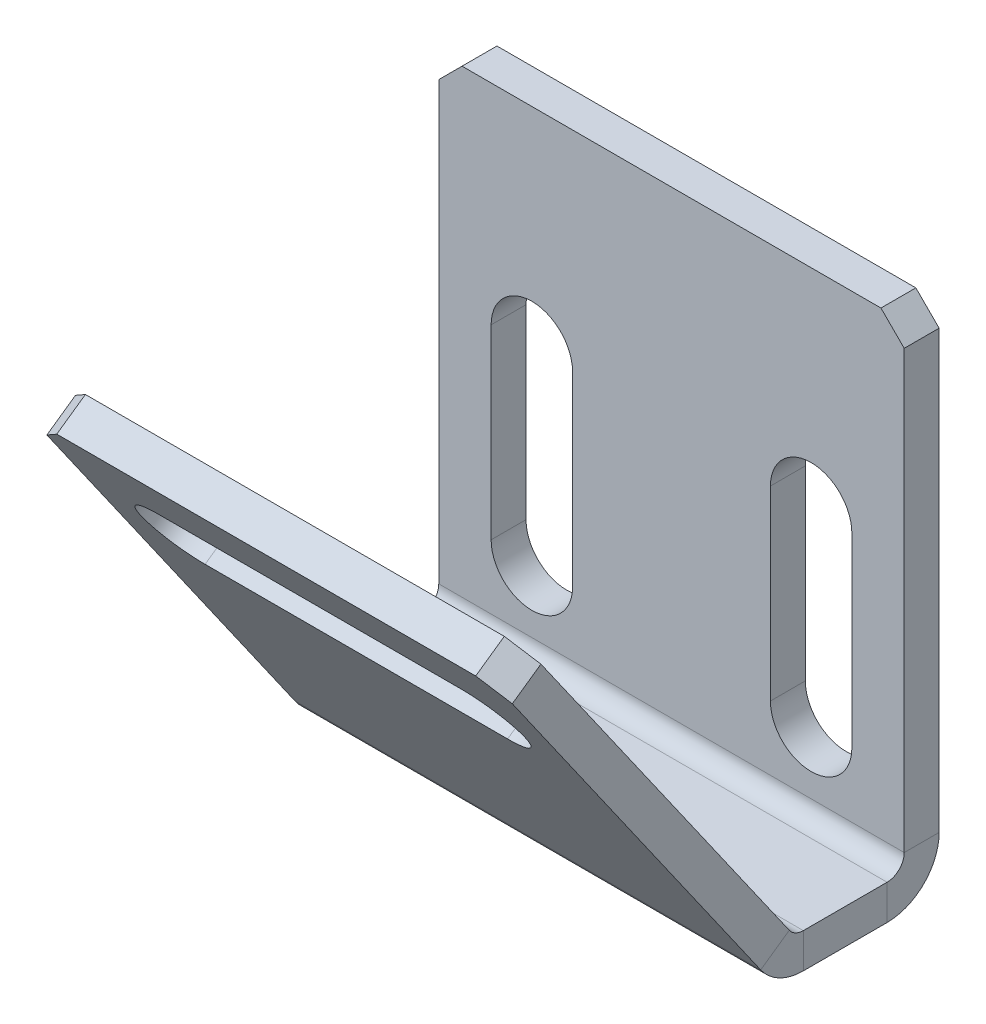
ISO-10303-21;
HEADER;
FILE_DESCRIPTION(('STEP AP214'),'2;1');
FILE_NAME('part.step','',(''),(''),'','','');
FILE_SCHEMA(('AUTOMOTIVE_DESIGN { 1 0 10303 214 1 1 1 1 }'));
ENDSEC;
DATA;
#1=APPLICATION_CONTEXT('core data for automotive mechanical design processes');
#2=APPLICATION_PROTOCOL_DEFINITION('international standard','automotive_design',2000,#1);
#3=PRODUCT_CONTEXT('',#1,'mechanical');
#4=PRODUCT('Part','Part','',(#3));
#5=PRODUCT_RELATED_PRODUCT_CATEGORY('part','',(#4));
#6=PRODUCT_DEFINITION_FORMATION('','',#4);
#7=PRODUCT_DEFINITION_CONTEXT('part definition',#1,'design');
#8=PRODUCT_DEFINITION('design','',#6,#7);
#9=PRODUCT_DEFINITION_SHAPE('','',#8);
#10=(LENGTH_UNIT() NAMED_UNIT(*) SI_UNIT(.MILLI.,.METRE.));
#11=(NAMED_UNIT(*) PLANE_ANGLE_UNIT() SI_UNIT($,.RADIAN.));
#12=(NAMED_UNIT(*) SI_UNIT($,.STERADIAN.) SOLID_ANGLE_UNIT());
#13=UNCERTAINTY_MEASURE_WITH_UNIT(LENGTH_MEASURE(1.E-05),#10,'distance_accuracy_value','');
#14=(GEOMETRIC_REPRESENTATION_CONTEXT(3) GLOBAL_UNCERTAINTY_ASSIGNED_CONTEXT((#13)) GLOBAL_UNIT_ASSIGNED_CONTEXT((#10,
#11,#12)) REPRESENTATION_CONTEXT('',''));
#15=CARTESIAN_POINT('',(0.,0.,0.));
#16=DIRECTION('',(0.,0.,1.));
#17=DIRECTION('',(1.,0.,0.));
#18=AXIS2_PLACEMENT_3D('',#15,#16,#17);
#19=CARTESIAN_POINT('',(11.0198412698413,-21.9206349206349,6.55));
#20=DIRECTION('',(-1.,0.,0.));
#21=DIRECTION('',(0.,0.,1.));
#22=AXIS2_PLACEMENT_3D('',#19,#20,#21);
#23=PLANE('',#22);
#24=DIRECTION('',(0.,-1.,0.));
#25=VECTOR('',#24,1.);
#26=CARTESIAN_POINT('',(11.0198412698413,-20.4206349206349,4.3353884274214));
#27=LINE('',#26,#25);
#28=CARTESIAN_POINT('',(11.0198412698413,-20.4206349206349,4.3353884274214));
#29=VERTEX_POINT('',#28);
#30=CARTESIAN_POINT('',(11.0198412698413,-21.9206349206349,4.3353884274214));
#31=VERTEX_POINT('',#30);
#32=EDGE_CURVE('E328',#29,#31,#27,.T.);
#33=ORIENTED_EDGE('',*,*,#32,.T.);
#34=DIRECTION('',(0.,0.,1.));
#35=VECTOR('',#34,1.);
#36=CARTESIAN_POINT('',(11.0198412698413,-21.9206349206349,0.));
#37=LINE('',#36,#35);
#38=CARTESIAN_POINT('',(11.0198412698413,-21.9206349206349,0.736599999999991));
#39=VERTEX_POINT('',#38);
#40=EDGE_CURVE('E348',#39,#31,#37,.T.);
#41=ORIENTED_EDGE('',*,*,#40,.F.);
#42=DIRECTION('',(0.,1.,0.));
#43=VECTOR('',#42,1.);
#44=CARTESIAN_POINT('',(11.0198412698413,-20.4206349206349,0.736599999999997));
#45=LINE('',#44,#43);
#46=CARTESIAN_POINT('',(11.0198412698413,-20.4206349206349,0.736599999999997));
#47=VERTEX_POINT('',#46);
#48=EDGE_CURVE('E358',#47,#39,#45,.F.);
#49=ORIENTED_EDGE('',*,*,#48,.F.);
#50=DIRECTION('',(0.,0.,-1.));
#51=VECTOR('',#50,1.);
#52=CARTESIAN_POINT('',(11.0198412698413,-20.4206349206349,6.55000000000001));
#53=LINE('',#52,#51);
#54=EDGE_CURVE('E352',#47,#29,#53,.F.);
#55=ORIENTED_EDGE('',*,*,#54,.T.);
#56=EDGE_LOOP('',(#33,#41,#49,#55));
#57=FACE_BOUND('',#56,.T.);
#58=ADVANCED_FACE('F76',(#57),#23,.F.);
#59=CARTESIAN_POINT('',(-8.98015873015873,-21.9206349206349,0.));
#60=DIRECTION('',(1.,0.,0.));
#61=DIRECTION('',(0.,0.,-1.));
#62=AXIS2_PLACEMENT_3D('',#59,#60,#61);
#63=PLANE('',#62);
#64=DIRECTION('',(0.,-1.,0.));
#65=VECTOR('',#64,1.);
#66=CARTESIAN_POINT('',(-8.98015873015873,-20.4206349206349,4.3353884274214));
#67=LINE('',#66,#65);
#68=CARTESIAN_POINT('',(-8.98015873015873,-20.4206349206349,4.3353884274214));
#69=VERTEX_POINT('',#68);
#70=CARTESIAN_POINT('',(-8.98015873015873,-21.9206349206349,4.3353884274214));
#71=VERTEX_POINT('',#70);
#72=EDGE_CURVE('E339',#69,#71,#67,.T.);
#73=ORIENTED_EDGE('',*,*,#72,.F.);
#74=DIRECTION('',(0.,0.,1.));
#75=VECTOR('',#74,1.);
#76=CARTESIAN_POINT('',(-8.98015873015873,-20.4206349206349,0.));
#77=LINE('',#76,#75);
#78=CARTESIAN_POINT('',(-8.98015873015873,-20.4206349206349,0.736599999999997));
#79=VERTEX_POINT('',#78);
#80=EDGE_CURVE('E350',#69,#79,#77,.F.);
#81=ORIENTED_EDGE('',*,*,#80,.T.);
#82=DIRECTION('',(0.,1.,0.));
#83=VECTOR('',#82,1.);
#84=CARTESIAN_POINT('',(-8.98015873015873,-21.9206349206349,0.736599999999991));
#85=LINE('',#84,#83);
#86=CARTESIAN_POINT('',(-8.98015873015873,-21.9206349206349,0.736599999999991));
#87=VERTEX_POINT('',#86);
#88=EDGE_CURVE('E342',#79,#87,#85,.F.);
#89=ORIENTED_EDGE('',*,*,#88,.T.);
#90=DIRECTION('',(0.,0.,-1.));
#91=VECTOR('',#90,1.);
#92=CARTESIAN_POINT('',(-8.98015873015873,-21.9206349206349,0.));
#93=LINE('',#92,#91);
#94=EDGE_CURVE('E345',#71,#87,#93,.T.);
#95=ORIENTED_EDGE('',*,*,#94,.F.);
#96=EDGE_LOOP('',(#73,#81,#89,#95));
#97=FACE_BOUND('',#96,.T.);
#98=ADVANCED_FACE('F532',(#97),#63,.F.);
#99=CARTESIAN_POINT('',(0.,-21.9206349206349,0.));
#100=DIRECTION('',(0.,1.,0.));
#101=DIRECTION('',(0.,0.,1.));
#102=AXIS2_PLACEMENT_3D('',#99,#100,#101);
#103=PLANE('',#102);
#104=DIRECTION('',(1.,0.,0.));
#105=VECTOR('',#104,1.);
#106=CARTESIAN_POINT('',(11.0198412698413,-21.9206349206349,4.3353884274214));
#107=LINE('',#106,#105);
#108=EDGE_CURVE('E322',#31,#71,#107,.F.);
#109=ORIENTED_EDGE('',*,*,#108,.T.);
#110=ORIENTED_EDGE('',*,*,#94,.T.);
#111=DIRECTION('',(1.,0.,0.));
#112=VECTOR('',#111,1.);
#113=CARTESIAN_POINT('',(-8.98015873015873,-21.9206349206349,0.736599999999991));
#114=LINE('',#113,#112);
#115=EDGE_CURVE('E355',#39,#87,#114,.F.);
#116=ORIENTED_EDGE('',*,*,#115,.F.);
#117=ORIENTED_EDGE('',*,*,#40,.T.);
#118=EDGE_LOOP('',(#109,#110,#116,#117));
#119=FACE_BOUND('',#118,.T.);
#120=ADVANCED_FACE('F538',(#119),#103,.F.);
#121=CARTESIAN_POINT('',(0.,-20.4206349206349,0.));
#122=DIRECTION('',(0.,1.,0.));
#123=DIRECTION('',(0.,0.,1.));
#124=AXIS2_PLACEMENT_3D('',#121,#122,#123);
#125=PLANE('',#124);
#126=ORIENTED_EDGE('',*,*,#80,.F.);
#127=DIRECTION('',(1.,0.,0.));
#128=VECTOR('',#127,1.);
#129=CARTESIAN_POINT('',(11.0198412698413,-20.4206349206349,4.3353884274214));
#130=LINE('',#129,#128);
#131=EDGE_CURVE('E334',#29,#69,#130,.F.);
#132=ORIENTED_EDGE('',*,*,#131,.F.);
#133=ORIENTED_EDGE('',*,*,#54,.F.);
#134=DIRECTION('',(1.,0.,0.));
#135=VECTOR('',#134,1.);
#136=CARTESIAN_POINT('',(-8.98015873015873,-20.4206349206349,0.736599999999997));
#137=LINE('',#136,#135);
#138=EDGE_CURVE('E361',#79,#47,#137,.T.);
#139=ORIENTED_EDGE('',*,*,#138,.F.);
#140=EDGE_LOOP('',(#126,#132,#133,#139));
#141=FACE_BOUND('',#140,.T.);
#142=ADVANCED_FACE('F603',(#141),#125,.T.);
#143=CARTESIAN_POINT('',(11.0198412698413,0.0793650793650749,-1.5));
#144=DIRECTION('',(1.,0.,0.));
#145=DIRECTION('',(0.,1.,0.));
#146=AXIS2_PLACEMENT_3D('',#143,#144,#145);
#147=PLANE('',#146);
#148=DIRECTION('',(0.,1.,0.));
#149=VECTOR('',#148,1.);
#150=CARTESIAN_POINT('',(11.0198412698413,0.0793650793650749,-1.5));
#151=LINE('',#150,#149);
#152=CARTESIAN_POINT('',(11.0198412698413,-19.6840349206349,-1.5));
#153=VERTEX_POINT('',#152);
#154=CARTESIAN_POINT('',(11.0198412698413,-0.920634920634923,-1.5));
#155=VERTEX_POINT('',#154);
#156=EDGE_CURVE('E455',#153,#155,#151,.T.);
#157=ORIENTED_EDGE('',*,*,#156,.T.);
#158=DIRECTION('',(0.,0.,1.));
#159=VECTOR('',#158,1.);
#160=CARTESIAN_POINT('',(11.0198412698413,-0.920634920634923,-1.5));
#161=LINE('',#160,#159);
#162=CARTESIAN_POINT('',(11.0198412698413,-0.920634920634923,0.));
#163=VERTEX_POINT('',#162);
#164=EDGE_CURVE('E474',#155,#163,#161,.T.);
#165=ORIENTED_EDGE('',*,*,#164,.T.);
#166=DIRECTION('',(0.,1.,0.));
#167=VECTOR('',#166,1.);
#168=CARTESIAN_POINT('',(11.0198412698413,0.0793650793650749,0.));
#169=LINE('',#168,#167);
#170=CARTESIAN_POINT('',(11.0198412698413,-19.6840349206349,0.));
#171=VERTEX_POINT('',#170);
#172=EDGE_CURVE('E464',#171,#163,#169,.T.);
#173=ORIENTED_EDGE('',*,*,#172,.F.);
#174=DIRECTION('',(0.,0.,-1.));
#175=VECTOR('',#174,1.);
#176=CARTESIAN_POINT('',(11.0198412698413,-19.6840349206349,0.));
#177=LINE('',#176,#175);
#178=EDGE_CURVE('E372',#171,#153,#177,.T.);
#179=ORIENTED_EDGE('',*,*,#178,.T.);
#180=EDGE_LOOP('',(#157,#165,#173,#179));
#181=FACE_BOUND('',#180,.T.);
#182=ADVANCED_FACE('F519',(#181),#147,.T.);
#183=CARTESIAN_POINT('',(0.,0.,-1.5));
#184=DIRECTION('',(0.,0.,1.));
#185=DIRECTION('',(1.,0.,0.));
#186=AXIS2_PLACEMENT_3D('',#183,#184,#185);
#187=PLANE('',#186);
#188=DIRECTION('',(0.,1.,0.));
#189=VECTOR('',#188,1.);
#190=CARTESIAN_POINT('',(-3.23015873015873,-8.92063492063492,-1.5));
#191=LINE('',#190,#189);
#192=CARTESIAN_POINT('',(-3.23015873015873,-16.9206349206349,-1.5));
#193=VERTEX_POINT('',#192);
#194=CARTESIAN_POINT('',(-3.23015873015873,-8.92063492063492,-1.5));
#195=VERTEX_POINT('',#194);
#196=EDGE_CURVE('E431',#193,#195,#191,.T.);
#197=ORIENTED_EDGE('',*,*,#196,.T.);
#198=CARTESIAN_POINT('',(-4.98015873015873,-8.92063492063492,-1.5));
#199=DIRECTION('',(0.,0.,1.));
#200=DIRECTION('',(1.,0.,0.));
#201=AXIS2_PLACEMENT_3D('',#198,#199,#200);
#202=CIRCLE('',#201,1.75);
#203=CARTESIAN_POINT('',(-6.73015873015873,-8.92063492063492,-1.5));
#204=VERTEX_POINT('',#203);
#205=EDGE_CURVE('E421',#195,#204,#202,.T.);
#206=ORIENTED_EDGE('',*,*,#205,.T.);
#207=DIRECTION('',(0.,-1.,0.));
#208=VECTOR('',#207,1.);
#209=CARTESIAN_POINT('',(-6.73015873015873,-8.92063492063492,-1.5));
#210=LINE('',#209,#208);
#211=CARTESIAN_POINT('',(-6.73015873015873,-16.9206349206349,-1.5));
#212=VERTEX_POINT('',#211);
#213=EDGE_CURVE('E424',#204,#212,#210,.T.);
#214=ORIENTED_EDGE('',*,*,#213,.T.);
#215=CARTESIAN_POINT('',(-4.98015873015873,-16.9206349206349,-1.5));
#216=DIRECTION('',(0.,0.,1.));
#217=DIRECTION('',(1.,0.,0.));
#218=AXIS2_PLACEMENT_3D('',#215,#216,#217);
#219=CIRCLE('',#218,1.75);
#220=EDGE_CURVE('E428',#212,#193,#219,.T.);
#221=ORIENTED_EDGE('',*,*,#220,.T.);
#222=EDGE_LOOP('',(#197,#206,#214,#221));
#223=FACE_BOUND('',#222,.T.);
#224=DIRECTION('',(0.,1.,0.));
#225=VECTOR('',#224,1.);
#226=CARTESIAN_POINT('',(8.76984126984127,-8.92063492063492,-1.5));
#227=LINE('',#226,#225);
#228=CARTESIAN_POINT('',(8.76984126984127,-16.9206349206349,-1.5));
#229=VERTEX_POINT('',#228);
#230=CARTESIAN_POINT('',(8.76984126984127,-8.92063492063492,-1.5));
#231=VERTEX_POINT('',#230);
#232=EDGE_CURVE('E399',#229,#231,#227,.T.);
#233=ORIENTED_EDGE('',*,*,#232,.T.);
#234=CARTESIAN_POINT('',(7.01984126984127,-8.92063492063492,-1.5));
#235=DIRECTION('',(0.,0.,1.));
#236=DIRECTION('',(1.,0.,0.));
#237=AXIS2_PLACEMENT_3D('',#234,#235,#236);
#238=CIRCLE('',#237,1.75);
#239=CARTESIAN_POINT('',(5.26984126984127,-8.92063492063492,-1.5));
#240=VERTEX_POINT('',#239);
#241=EDGE_CURVE('E389',#231,#240,#238,.T.);
#242=ORIENTED_EDGE('',*,*,#241,.T.);
#243=DIRECTION('',(0.,-1.,0.));
#244=VECTOR('',#243,1.);
#245=CARTESIAN_POINT('',(5.26984126984127,-8.92063492063492,-1.5));
#246=LINE('',#245,#244);
#247=CARTESIAN_POINT('',(5.26984126984127,-16.9206349206349,-1.5));
#248=VERTEX_POINT('',#247);
#249=EDGE_CURVE('E392',#240,#248,#246,.T.);
#250=ORIENTED_EDGE('',*,*,#249,.T.);
#251=CARTESIAN_POINT('',(7.01984126984127,-16.9206349206349,-1.5));
#252=DIRECTION('',(0.,0.,1.));
#253=DIRECTION('',(1.,0.,0.));
#254=AXIS2_PLACEMENT_3D('',#251,#252,#253);
#255=CIRCLE('',#254,1.75);
#256=EDGE_CURVE('E396',#248,#229,#255,.T.);
#257=ORIENTED_EDGE('',*,*,#256,.T.);
#258=EDGE_LOOP('',(#233,#242,#250,#257));
#259=FACE_BOUND('',#258,.T.);
#260=DIRECTION('',(0.,-1.,0.));
#261=VECTOR('',#260,1.);
#262=CARTESIAN_POINT('',(-8.98015873015873,0.0793650793650749,-1.5));
#263=LINE('',#262,#261);
#264=CARTESIAN_POINT('',(-8.98015873015873,-0.92063492063494,-1.5));
#265=VERTEX_POINT('',#264);
#266=CARTESIAN_POINT('',(-8.98015873015873,-19.6840349206349,-1.5));
#267=VERTEX_POINT('',#266);
#268=EDGE_CURVE('E453',#265,#267,#263,.T.);
#269=ORIENTED_EDGE('',*,*,#268,.F.);
#270=DIRECTION('',(-0.707106781186546,-0.707106781186549,0.));
#271=VECTOR('',#270,1.);
#272=CARTESIAN_POINT('',(-7.98015873015872,0.0793650793650749,-1.5));
#273=LINE('',#272,#271);
#274=CARTESIAN_POINT('',(-7.98015873015872,0.0793650793650749,-1.5));
#275=VERTEX_POINT('',#274);
#276=EDGE_CURVE('E13',#265,#275,#273,.F.);
#277=ORIENTED_EDGE('',*,*,#276,.T.);
#278=DIRECTION('',(-1.,0.,0.));
#279=VECTOR('',#278,1.);
#280=CARTESIAN_POINT('',(-8.98015873015873,0.0793650793650749,-1.5));
#281=LINE('',#280,#279);
#282=CARTESIAN_POINT('',(10.0198412698413,0.0793650793650749,-1.5));
#283=VERTEX_POINT('',#282);
#284=EDGE_CURVE('E459',#283,#275,#281,.T.);
#285=ORIENTED_EDGE('',*,*,#284,.F.);
#286=DIRECTION('',(-0.707106781186549,0.707106781186546,0.));
#287=VECTOR('',#286,1.);
#288=CARTESIAN_POINT('',(11.0198412698413,-0.920634920634922,-1.5));
#289=LINE('',#288,#287);
#290=EDGE_CURVE('E481',#283,#155,#289,.F.);
#291=ORIENTED_EDGE('',*,*,#290,.T.);
#292=ORIENTED_EDGE('',*,*,#156,.F.);
#293=DIRECTION('',(1.,0.,0.));
#294=VECTOR('',#293,1.);
#295=CARTESIAN_POINT('',(11.0198412698413,-19.6840349206349,-1.5));
#296=LINE('',#295,#294);
#297=EDGE_CURVE('E365',#153,#267,#296,.F.);
#298=ORIENTED_EDGE('',*,*,#297,.T.);
#299=EDGE_LOOP('',(#269,#277,#285,#291,#292,#298));
#300=FACE_BOUND('',#299,.T.);
#301=ADVANCED_FACE('F523',(#223,#259,#300),#187,.F.);
#302=CARTESIAN_POINT('',(0.,0.,0.));
#303=DIRECTION('',(0.,0.,1.));
#304=DIRECTION('',(1.,0.,0.));
#305=AXIS2_PLACEMENT_3D('',#302,#303,#304);
#306=PLANE('',#305);
#307=CARTESIAN_POINT('',(7.01984126984127,-8.92063492063492,0.));
#308=DIRECTION('',(0.,0.,1.));
#309=DIRECTION('',(1.,0.,0.));
#310=AXIS2_PLACEMENT_3D('',#307,#308,#309);
#311=CIRCLE('',#310,1.75);
#312=CARTESIAN_POINT('',(8.76984126984127,-8.92063492063492,0.));
#313=VERTEX_POINT('',#312);
#314=CARTESIAN_POINT('',(5.26984126984127,-8.92063492063492,0.));
#315=VERTEX_POINT('',#314);
#316=EDGE_CURVE('E386',#313,#315,#311,.T.);
#317=ORIENTED_EDGE('',*,*,#316,.F.);
#318=DIRECTION('',(0.,1.,0.));
#319=VECTOR('',#318,1.);
#320=CARTESIAN_POINT('',(8.76984126984127,-8.92063492063492,0.));
#321=LINE('',#320,#319);
#322=CARTESIAN_POINT('',(8.76984126984127,-16.9206349206349,0.));
#323=VERTEX_POINT('',#322);
#324=EDGE_CURVE('E393',#323,#313,#321,.T.);
#325=ORIENTED_EDGE('',*,*,#324,.F.);
#326=CARTESIAN_POINT('',(7.01984126984127,-16.9206349206349,0.));
#327=DIRECTION('',(0.,0.,1.));
#328=DIRECTION('',(1.,0.,0.));
#329=AXIS2_PLACEMENT_3D('',#326,#327,#328);
#330=CIRCLE('',#329,1.75);
#331=CARTESIAN_POINT('',(5.26984126984127,-16.9206349206349,0.));
#332=VERTEX_POINT('',#331);
#333=EDGE_CURVE('E407',#332,#323,#330,.T.);
#334=ORIENTED_EDGE('',*,*,#333,.F.);
#335=DIRECTION('',(0.,-1.,0.));
#336=VECTOR('',#335,1.);
#337=CARTESIAN_POINT('',(5.26984126984127,-8.92063492063492,0.));
#338=LINE('',#337,#336);
#339=EDGE_CURVE('E404',#315,#332,#338,.T.);
#340=ORIENTED_EDGE('',*,*,#339,.F.);
#341=EDGE_LOOP('',(#317,#325,#334,#340));
#342=FACE_BOUND('',#341,.T.);
#343=CARTESIAN_POINT('',(-4.98015873015873,-8.92063492063492,0.));
#344=DIRECTION('',(0.,0.,1.));
#345=DIRECTION('',(1.,0.,0.));
#346=AXIS2_PLACEMENT_3D('',#343,#344,#345);
#347=CIRCLE('',#346,1.75);
#348=CARTESIAN_POINT('',(-3.23015873015873,-8.92063492063492,0.));
#349=VERTEX_POINT('',#348);
#350=CARTESIAN_POINT('',(-6.73015873015873,-8.92063492063492,0.));
#351=VERTEX_POINT('',#350);
#352=EDGE_CURVE('E414',#349,#351,#347,.T.);
#353=ORIENTED_EDGE('',*,*,#352,.F.);
#354=DIRECTION('',(0.,1.,0.));
#355=VECTOR('',#354,1.);
#356=CARTESIAN_POINT('',(-3.23015873015873,-8.92063492063492,0.));
#357=LINE('',#356,#355);
#358=CARTESIAN_POINT('',(-3.23015873015873,-16.9206349206349,0.));
#359=VERTEX_POINT('',#358);
#360=EDGE_CURVE('E425',#359,#349,#357,.T.);
#361=ORIENTED_EDGE('',*,*,#360,.F.);
#362=CARTESIAN_POINT('',(-4.98015873015873,-16.9206349206349,0.));
#363=DIRECTION('',(0.,0.,1.));
#364=DIRECTION('',(1.,0.,0.));
#365=AXIS2_PLACEMENT_3D('',#362,#363,#364);
#366=CIRCLE('',#365,1.75);
#367=CARTESIAN_POINT('',(-6.73015873015873,-16.9206349206349,0.));
#368=VERTEX_POINT('',#367);
#369=EDGE_CURVE('E439',#368,#359,#366,.T.);
#370=ORIENTED_EDGE('',*,*,#369,.F.);
#371=DIRECTION('',(0.,-1.,0.));
#372=VECTOR('',#371,1.);
#373=CARTESIAN_POINT('',(-6.73015873015873,-8.92063492063492,0.));
#374=LINE('',#373,#372);
#375=EDGE_CURVE('E436',#351,#368,#374,.T.);
#376=ORIENTED_EDGE('',*,*,#375,.F.);
#377=EDGE_LOOP('',(#353,#361,#370,#376));
#378=FACE_BOUND('',#377,.T.);
#379=DIRECTION('',(-1.,0.,0.));
#380=VECTOR('',#379,1.);
#381=CARTESIAN_POINT('',(-8.98015873015873,0.0793650793650749,0.));
#382=LINE('',#381,#380);
#383=CARTESIAN_POINT('',(10.0198412698413,0.0793650793650749,0.));
#384=VERTEX_POINT('',#383);
#385=CARTESIAN_POINT('',(-7.98015873015872,0.0793650793650749,0.));
#386=VERTEX_POINT('',#385);
#387=EDGE_CURVE('E456',#384,#386,#382,.T.);
#388=ORIENTED_EDGE('',*,*,#387,.T.);
#389=DIRECTION('',(0.707106781186546,0.707106781186549,0.));
#390=VECTOR('',#389,1.);
#391=CARTESIAN_POINT('',(-4.02976190476191,4.0297619047619,0.));
#392=LINE('',#391,#390);
#393=CARTESIAN_POINT('',(-8.98015873015873,-0.92063492063494,0.));
#394=VERTEX_POINT('',#393);
#395=EDGE_CURVE('E98',#386,#394,#392,.F.);
#396=ORIENTED_EDGE('',*,*,#395,.T.);
#397=DIRECTION('',(0.,-1.,0.));
#398=VECTOR('',#397,1.);
#399=CARTESIAN_POINT('',(-8.98015873015873,0.0793650793650749,0.));
#400=LINE('',#399,#398);
#401=CARTESIAN_POINT('',(-8.98015873015873,-19.6840349206349,0.));
#402=VERTEX_POINT('',#401);
#403=EDGE_CURVE('E446',#394,#402,#400,.T.);
#404=ORIENTED_EDGE('',*,*,#403,.T.);
#405=DIRECTION('',(1.,0.,0.));
#406=VECTOR('',#405,1.);
#407=CARTESIAN_POINT('',(11.0198412698413,-19.6840349206349,0.));
#408=LINE('',#407,#406);
#409=EDGE_CURVE('E378',#171,#402,#408,.F.);
#410=ORIENTED_EDGE('',*,*,#409,.F.);
#411=ORIENTED_EDGE('',*,*,#172,.T.);
#412=DIRECTION('',(0.707106781186549,-0.707106781186546,0.));
#413=VECTOR('',#412,1.);
#414=CARTESIAN_POINT('',(5.04960317460315,5.04960317460317,0.));
#415=LINE('',#414,#413);
#416=EDGE_CURVE('E477',#163,#384,#415,.F.);
#417=ORIENTED_EDGE('',*,*,#416,.T.);
#418=EDGE_LOOP('',(#388,#396,#404,#410,#411,#417));
#419=FACE_BOUND('',#418,.T.);
#420=ADVANCED_FACE('F512',(#342,#378,#419),#306,.T.);
#421=CARTESIAN_POINT('',(-8.98015873015873,0.0793650793650749,-1.5));
#422=DIRECTION('',(-1.,0.,0.));
#423=DIRECTION('',(0.,-1.,0.));
#424=AXIS2_PLACEMENT_3D('',#421,#422,#423);
#425=PLANE('',#424);
#426=ORIENTED_EDGE('',*,*,#403,.F.);
#427=DIRECTION('',(0.,0.,-1.));
#428=VECTOR('',#427,1.);
#429=CARTESIAN_POINT('',(-8.98015873015873,-0.92063492063494,-1.5));
#430=LINE('',#429,#428);
#431=EDGE_CURVE('E84',#394,#265,#430,.T.);
#432=ORIENTED_EDGE('',*,*,#431,.T.);
#433=ORIENTED_EDGE('',*,*,#268,.T.);
#434=DIRECTION('',(0.,0.,-1.));
#435=VECTOR('',#434,1.);
#436=CARTESIAN_POINT('',(-8.98015873015873,-19.6840349206349,0.));
#437=LINE('',#436,#435);
#438=EDGE_CURVE('E383',#402,#267,#437,.T.);
#439=ORIENTED_EDGE('',*,*,#438,.F.);
#440=EDGE_LOOP('',(#426,#432,#433,#439));
#441=FACE_BOUND('',#440,.T.);
#442=ADVANCED_FACE('F597',(#441),#425,.T.);
#443=CARTESIAN_POINT('',(-8.98015873015873,0.0793650793650749,-1.5));
#444=DIRECTION('',(0.,1.,0.));
#445=DIRECTION('',(0.,0.,1.));
#446=AXIS2_PLACEMENT_3D('',#443,#444,#445);
#447=PLANE('',#446);
#448=ORIENTED_EDGE('',*,*,#284,.T.);
#449=DIRECTION('',(0.,0.,1.));
#450=VECTOR('',#449,1.);
#451=CARTESIAN_POINT('',(-7.98015873015872,0.0793650793650749,-1.5));
#452=LINE('',#451,#450);
#453=EDGE_CURVE('E501',#275,#386,#452,.T.);
#454=ORIENTED_EDGE('',*,*,#453,.T.);
#455=ORIENTED_EDGE('',*,*,#387,.F.);
#456=DIRECTION('',(0.,0.,-1.));
#457=VECTOR('',#456,1.);
#458=CARTESIAN_POINT('',(10.0198412698413,0.0793650793650749,-1.5));
#459=LINE('',#458,#457);
#460=EDGE_CURVE('E479',#384,#283,#459,.T.);
#461=ORIENTED_EDGE('',*,*,#460,.T.);
#462=EDGE_LOOP('',(#448,#454,#455,#461));
#463=FACE_BOUND('',#462,.T.);
#464=ADVANCED_FACE('F507',(#463),#447,.T.);
#465=CARTESIAN_POINT('',(-4.98015873015873,-8.92063492063492,-1.5));
#466=DIRECTION('',(0.,0.,1.));
#467=DIRECTION('',(1.,0.,0.));
#468=AXIS2_PLACEMENT_3D('',#465,#466,#467);
#469=CYLINDRICAL_SURFACE('',#468,1.75);
#470=ORIENTED_EDGE('',*,*,#352,.T.);
#471=DIRECTION('',(0.,0.,1.));
#472=VECTOR('',#471,1.);
#473=CARTESIAN_POINT('',(-6.73015873015873,-8.92063492063492,-1.5));
#474=LINE('',#473,#472);
#475=EDGE_CURVE('E434',#204,#351,#474,.T.);
#476=ORIENTED_EDGE('',*,*,#475,.F.);
#477=ORIENTED_EDGE('',*,*,#205,.F.);
#478=DIRECTION('',(0.,0.,1.));
#479=VECTOR('',#478,1.);
#480=CARTESIAN_POINT('',(-3.23015873015873,-8.92063492063492,-1.5));
#481=LINE('',#480,#479);
#482=EDGE_CURVE('E444',#195,#349,#481,.T.);
#483=ORIENTED_EDGE('',*,*,#482,.T.);
#484=EDGE_LOOP('',(#470,#476,#477,#483));
#485=FACE_BOUND('',#484,.T.);
#486=ADVANCED_FACE('F581',(#485),#469,.F.);
#487=CARTESIAN_POINT('',(-3.23015873015873,-8.92063492063492,-1.5));
#488=DIRECTION('',(1.,0.,0.));
#489=DIRECTION('',(0.,1.,0.));
#490=AXIS2_PLACEMENT_3D('',#487,#488,#489);
#491=PLANE('',#490);
#492=ORIENTED_EDGE('',*,*,#360,.T.);
#493=ORIENTED_EDGE('',*,*,#482,.F.);
#494=ORIENTED_EDGE('',*,*,#196,.F.);
#495=DIRECTION('',(0.,0.,1.));
#496=VECTOR('',#495,1.);
#497=CARTESIAN_POINT('',(-3.23015873015873,-16.9206349206349,-1.5));
#498=LINE('',#497,#496);
#499=EDGE_CURVE('E447',#193,#359,#498,.T.);
#500=ORIENTED_EDGE('',*,*,#499,.T.);
#501=EDGE_LOOP('',(#492,#493,#494,#500));
#502=FACE_BOUND('',#501,.T.);
#503=ADVANCED_FACE('F577',(#502),#491,.F.);
#504=CARTESIAN_POINT('',(-4.98015873015873,-16.9206349206349,-1.5));
#505=DIRECTION('',(0.,0.,1.));
#506=DIRECTION('',(1.,0.,0.));
#507=AXIS2_PLACEMENT_3D('',#504,#505,#506);
#508=CYLINDRICAL_SURFACE('',#507,1.75);
#509=ORIENTED_EDGE('',*,*,#369,.T.);
#510=ORIENTED_EDGE('',*,*,#499,.F.);
#511=ORIENTED_EDGE('',*,*,#220,.F.);
#512=DIRECTION('',(0.,0.,1.));
#513=VECTOR('',#512,1.);
#514=CARTESIAN_POINT('',(-6.73015873015873,-16.9206349206349,-1.5));
#515=LINE('',#514,#513);
#516=EDGE_CURVE('E449',#212,#368,#515,.T.);
#517=ORIENTED_EDGE('',*,*,#516,.T.);
#518=EDGE_LOOP('',(#509,#510,#511,#517));
#519=FACE_BOUND('',#518,.T.);
#520=ADVANCED_FACE('F580',(#519),#508,.F.);
#521=CARTESIAN_POINT('',(-6.73015873015873,-8.92063492063492,-1.5));
#522=DIRECTION('',(-1.,0.,0.));
#523=DIRECTION('',(0.,-1.,0.));
#524=AXIS2_PLACEMENT_3D('',#521,#522,#523);
#525=PLANE('',#524);
#526=ORIENTED_EDGE('',*,*,#375,.T.);
#527=ORIENTED_EDGE('',*,*,#516,.F.);
#528=ORIENTED_EDGE('',*,*,#213,.F.);
#529=ORIENTED_EDGE('',*,*,#475,.T.);
#530=EDGE_LOOP('',(#526,#527,#528,#529));
#531=FACE_BOUND('',#530,.T.);
#532=ADVANCED_FACE('F575',(#531),#525,.F.);
#533=CARTESIAN_POINT('',(7.01984126984127,-8.92063492063492,-1.5));
#534=DIRECTION('',(0.,0.,1.));
#535=DIRECTION('',(1.,0.,0.));
#536=AXIS2_PLACEMENT_3D('',#533,#534,#535);
#537=CYLINDRICAL_SURFACE('',#536,1.75);
#538=ORIENTED_EDGE('',*,*,#316,.T.);
#539=DIRECTION('',(0.,0.,1.));
#540=VECTOR('',#539,1.);
#541=CARTESIAN_POINT('',(5.26984126984127,-8.92063492063492,-1.5));
#542=LINE('',#541,#540);
#543=EDGE_CURVE('E402',#240,#315,#542,.T.);
#544=ORIENTED_EDGE('',*,*,#543,.F.);
#545=ORIENTED_EDGE('',*,*,#241,.F.);
#546=DIRECTION('',(0.,0.,1.));
#547=VECTOR('',#546,1.);
#548=CARTESIAN_POINT('',(8.76984126984127,-8.92063492063492,-1.5));
#549=LINE('',#548,#547);
#550=EDGE_CURVE('E412',#231,#313,#549,.T.);
#551=ORIENTED_EDGE('',*,*,#550,.T.);
#552=EDGE_LOOP('',(#538,#544,#545,#551));
#553=FACE_BOUND('',#552,.T.);
#554=ADVANCED_FACE('F565',(#553),#537,.F.);
#555=CARTESIAN_POINT('',(8.76984126984127,-8.92063492063492,-1.5));
#556=DIRECTION('',(1.,0.,0.));
#557=DIRECTION('',(0.,0.,-1.));
#558=AXIS2_PLACEMENT_3D('',#555,#556,#557);
#559=PLANE('',#558);
#560=ORIENTED_EDGE('',*,*,#324,.T.);
#561=ORIENTED_EDGE('',*,*,#550,.F.);
#562=ORIENTED_EDGE('',*,*,#232,.F.);
#563=DIRECTION('',(0.,0.,1.));
#564=VECTOR('',#563,1.);
#565=CARTESIAN_POINT('',(8.76984126984127,-16.9206349206349,-1.5));
#566=LINE('',#565,#564);
#567=EDGE_CURVE('E415',#229,#323,#566,.T.);
#568=ORIENTED_EDGE('',*,*,#567,.T.);
#569=EDGE_LOOP('',(#560,#561,#562,#568));
#570=FACE_BOUND('',#569,.T.);
#571=ADVANCED_FACE('F561',(#570),#559,.F.);
#572=CARTESIAN_POINT('',(7.01984126984127,-16.9206349206349,-1.5));
#573=DIRECTION('',(0.,0.,1.));
#574=DIRECTION('',(1.,0.,0.));
#575=AXIS2_PLACEMENT_3D('',#572,#573,#574);
#576=CYLINDRICAL_SURFACE('',#575,1.75);
#577=ORIENTED_EDGE('',*,*,#333,.T.);
#578=ORIENTED_EDGE('',*,*,#567,.F.);
#579=ORIENTED_EDGE('',*,*,#256,.F.);
#580=DIRECTION('',(0.,0.,1.));
#581=VECTOR('',#580,1.);
#582=CARTESIAN_POINT('',(5.26984126984127,-16.9206349206349,-1.5));
#583=LINE('',#582,#581);
#584=EDGE_CURVE('E417',#248,#332,#583,.T.);
#585=ORIENTED_EDGE('',*,*,#584,.T.);
#586=EDGE_LOOP('',(#577,#578,#579,#585));
#587=FACE_BOUND('',#586,.T.);
#588=ADVANCED_FACE('F564',(#587),#576,.F.);
#589=CARTESIAN_POINT('',(5.26984126984127,-8.92063492063492,-1.5));
#590=DIRECTION('',(-1.,0.,0.));
#591=DIRECTION('',(0.,0.,1.));
#592=AXIS2_PLACEMENT_3D('',#589,#590,#591);
#593=PLANE('',#592);
#594=ORIENTED_EDGE('',*,*,#339,.T.);
#595=ORIENTED_EDGE('',*,*,#584,.F.);
#596=ORIENTED_EDGE('',*,*,#249,.F.);
#597=ORIENTED_EDGE('',*,*,#543,.T.);
#598=EDGE_LOOP('',(#594,#595,#596,#597));
#599=FACE_BOUND('',#598,.T.);
#600=ADVANCED_FACE('F556',(#599),#593,.F.);
#601=CARTESIAN_POINT('',(-8.98015873015873,-19.6840349206349,0.7366));
#602=DIRECTION('',(-1.,0.,0.));
#603=DIRECTION('',(0.,0.,1.));
#604=AXIS2_PLACEMENT_3D('',#601,#602,#603);
#605=PLANE('',#604);
#606=ORIENTED_EDGE('',*,*,#88,.F.);
#607=CARTESIAN_POINT('',(-8.98015873015873,-19.6840349206349,0.7366));
#608=DIRECTION('',(1.,0.,0.));
#609=DIRECTION('',(0.,0.,-1.));
#610=AXIS2_PLACEMENT_3D('',#607,#608,#609);
#611=CIRCLE('',#610,0.7366);
#612=EDGE_CURVE('E375',#402,#79,#611,.F.);
#613=ORIENTED_EDGE('',*,*,#612,.F.);
#614=ORIENTED_EDGE('',*,*,#438,.T.);
#615=CARTESIAN_POINT('',(-8.98015873015873,-19.6840349206349,0.7366));
#616=DIRECTION('',(1.,0.,0.));
#617=DIRECTION('',(0.,0.,-1.));
#618=AXIS2_PLACEMENT_3D('',#615,#616,#617);
#619=CIRCLE('',#618,2.2366);
#620=EDGE_CURVE('E368',#267,#87,#619,.F.);
#621=ORIENTED_EDGE('',*,*,#620,.T.);
#622=EDGE_LOOP('',(#606,#613,#614,#621));
#623=FACE_BOUND('',#622,.T.);
#624=ADVANCED_FACE('F553',(#623),#605,.T.);
#625=CARTESIAN_POINT('',(11.0198412698413,-19.6840349206349,0.7366));
#626=DIRECTION('',(-1.,0.,0.));
#627=DIRECTION('',(0.,0.,1.));
#628=AXIS2_PLACEMENT_3D('',#625,#626,#627);
#629=PLANE('',#628);
#630=CARTESIAN_POINT('',(11.0198412698413,-19.6840349206349,0.7366));
#631=DIRECTION('',(1.,0.,0.));
#632=DIRECTION('',(0.,0.,-1.));
#633=AXIS2_PLACEMENT_3D('',#630,#631,#632);
#634=CIRCLE('',#633,0.7366);
#635=EDGE_CURVE('E347',#47,#171,#634,.T.);
#636=ORIENTED_EDGE('',*,*,#635,.F.);
#637=ORIENTED_EDGE('',*,*,#48,.T.);
#638=CARTESIAN_POINT('',(11.0198412698413,-19.6840349206349,0.7366));
#639=DIRECTION('',(1.,0.,0.));
#640=DIRECTION('',(0.,0.,-1.));
#641=AXIS2_PLACEMENT_3D('',#638,#639,#640);
#642=CIRCLE('',#641,2.2366);
#643=EDGE_CURVE('E369',#39,#153,#642,.T.);
#644=ORIENTED_EDGE('',*,*,#643,.T.);
#645=ORIENTED_EDGE('',*,*,#178,.F.);
#646=EDGE_LOOP('',(#636,#637,#644,#645));
#647=FACE_BOUND('',#646,.T.);
#648=ADVANCED_FACE('F547',(#647),#629,.F.);
#649=CARTESIAN_POINT('',(11.0198412698413,-19.6840349206349,0.7366));
#650=DIRECTION('',(1.,0.,0.));
#651=DIRECTION('',(0.,-1.,0.));
#652=AXIS2_PLACEMENT_3D('',#649,#650,#651);
#653=CYLINDRICAL_SURFACE('',#652,2.2366);
#654=ORIENTED_EDGE('',*,*,#297,.F.);
#655=ORIENTED_EDGE('',*,*,#643,.F.);
#656=ORIENTED_EDGE('',*,*,#115,.T.);
#657=ORIENTED_EDGE('',*,*,#620,.F.);
#658=EDGE_LOOP('',(#654,#655,#656,#657));
#659=FACE_BOUND('',#658,.T.);
#660=ADVANCED_FACE('F543',(#659),#653,.T.);
#661=CARTESIAN_POINT('',(11.0198412698413,-19.6840349206349,0.7366));
#662=DIRECTION('',(1.,0.,0.));
#663=DIRECTION('',(0.,-1.,0.));
#664=AXIS2_PLACEMENT_3D('',#661,#662,#663);
#665=CYLINDRICAL_SURFACE('',#664,0.7366);
#666=ORIENTED_EDGE('',*,*,#409,.T.);
#667=ORIENTED_EDGE('',*,*,#612,.T.);
#668=ORIENTED_EDGE('',*,*,#138,.T.);
#669=ORIENTED_EDGE('',*,*,#635,.T.);
#670=EDGE_LOOP('',(#666,#667,#668,#669));
#671=FACE_BOUND('',#670,.T.);
#672=ADVANCED_FACE('F546',(#671),#665,.F.);
#673=CARTESIAN_POINT('',(-8.98015873015873,-19.6840349206349,4.3353884274214));
#674=DIRECTION('',(-1.,0.,0.));
#675=DIRECTION('',(0.,0.,1.));
#676=AXIS2_PLACEMENT_3D('',#673,#674,#675);
#677=PLANE('',#676);
#678=DIRECTION('',(0.,0.573576436351053,-0.819152044288987));
#679=VECTOR('',#678,1.);
#680=CARTESIAN_POINT('',(-8.98015873015873,-20.9668959781777,6.16750388967815));
#681=LINE('',#680,#679);
#682=CARTESIAN_POINT('',(-8.98015873015873,-20.1065313236511,4.93877582324467));
#683=VERTEX_POINT('',#682);
#684=CARTESIAN_POINT('',(-8.98015873015873,-20.9668959781777,6.16750388967815));
#685=VERTEX_POINT('',#684);
#686=EDGE_CURVE('E292',#683,#685,#681,.F.);
#687=ORIENTED_EDGE('',*,*,#686,.F.);
#688=CARTESIAN_POINT('',(-8.98015873015873,-19.6840349206349,4.3353884274214));
#689=DIRECTION('',(1.,0.,0.));
#690=DIRECTION('',(0.,0.,-1.));
#691=AXIS2_PLACEMENT_3D('',#688,#689,#690);
#692=CIRCLE('',#691,0.736599999999999);
#693=EDGE_CURVE('E331',#69,#683,#692,.F.);
#694=ORIENTED_EDGE('',*,*,#693,.F.);
#695=ORIENTED_EDGE('',*,*,#72,.T.);
#696=CARTESIAN_POINT('',(-8.98015873015873,-19.6840349206349,4.3353884274214));
#697=DIRECTION('',(1.,0.,0.));
#698=DIRECTION('',(0.,0.,-1.));
#699=AXIS2_PLACEMENT_3D('',#696,#697,#698);
#700=CIRCLE('',#699,2.2366);
#701=EDGE_CURVE('E324',#71,#685,#700,.F.);
#702=ORIENTED_EDGE('',*,*,#701,.T.);
#703=EDGE_LOOP('',(#687,#694,#695,#702));
#704=FACE_BOUND('',#703,.T.);
#705=ADVANCED_FACE('F551',(#704),#677,.T.);
#706=CARTESIAN_POINT('',(11.0198412698413,-19.6840349206349,4.3353884274214));
#707=DIRECTION('',(-1.,0.,0.));
#708=DIRECTION('',(0.,0.,1.));
#709=AXIS2_PLACEMENT_3D('',#706,#707,#708);
#710=PLANE('',#709);
#711=CARTESIAN_POINT('',(11.0198412698413,-19.6840349206349,4.3353884274214));
#712=DIRECTION('',(1.,0.,0.));
#713=DIRECTION('',(0.,0.,-1.));
#714=AXIS2_PLACEMENT_3D('',#711,#712,#713);
#715=CIRCLE('',#714,0.736599999999999);
#716=CARTESIAN_POINT('',(11.0198412698413,-20.1065313236511,4.93877582324467));
#717=VERTEX_POINT('',#716);
#718=EDGE_CURVE('E297',#717,#29,#715,.T.);
#719=ORIENTED_EDGE('',*,*,#718,.F.);
#720=DIRECTION('',(0.,0.573576436351053,-0.819152044288987));
#721=VECTOR('',#720,1.);
#722=CARTESIAN_POINT('',(11.0198412698413,-20.1065313236511,4.93877582324467));
#723=LINE('',#722,#721);
#724=CARTESIAN_POINT('',(11.0198412698413,-20.9668959781777,6.16750388967815));
#725=VERTEX_POINT('',#724);
#726=EDGE_CURVE('E315',#717,#725,#723,.F.);
#727=ORIENTED_EDGE('',*,*,#726,.T.);
#728=CARTESIAN_POINT('',(11.0198412698413,-19.6840349206349,4.3353884274214));
#729=DIRECTION('',(1.,0.,0.));
#730=DIRECTION('',(0.,0.,-1.));
#731=AXIS2_PLACEMENT_3D('',#728,#729,#730);
#732=CIRCLE('',#731,2.2366);
#733=EDGE_CURVE('E325',#725,#31,#732,.T.);
#734=ORIENTED_EDGE('',*,*,#733,.T.);
#735=ORIENTED_EDGE('',*,*,#32,.F.);
#736=EDGE_LOOP('',(#719,#727,#734,#735));
#737=FACE_BOUND('',#736,.T.);
#738=ADVANCED_FACE('F643',(#737),#710,.F.);
#739=CARTESIAN_POINT('',(11.0198412698413,-19.6840349206349,4.3353884274214));
#740=DIRECTION('',(1.,0.,0.));
#741=DIRECTION('',(0.,-0.573576436351053,0.819152044288987));
#742=AXIS2_PLACEMENT_3D('',#739,#740,#741);
#743=CYLINDRICAL_SURFACE('',#742,2.2366);
#744=ORIENTED_EDGE('',*,*,#108,.F.);
#745=ORIENTED_EDGE('',*,*,#733,.F.);
#746=DIRECTION('',(1.,0.,0.));
#747=VECTOR('',#746,1.);
#748=CARTESIAN_POINT('',(-8.98015873015873,-20.9668959781777,6.16750388967815));
#749=LINE('',#748,#747);
#750=EDGE_CURVE('E312',#725,#685,#749,.F.);
#751=ORIENTED_EDGE('',*,*,#750,.T.);
#752=ORIENTED_EDGE('',*,*,#701,.F.);
#753=EDGE_LOOP('',(#744,#745,#751,#752));
#754=FACE_BOUND('',#753,.T.);
#755=ADVANCED_FACE('F647',(#754),#743,.T.);
#756=CARTESIAN_POINT('',(11.0198412698413,-19.6840349206349,4.3353884274214));
#757=DIRECTION('',(1.,0.,0.));
#758=DIRECTION('',(0.,-0.573576436351053,0.819152044288987));
#759=AXIS2_PLACEMENT_3D('',#756,#757,#758);
#760=CYLINDRICAL_SURFACE('',#759,0.736599999999999);
#761=ORIENTED_EDGE('',*,*,#131,.T.);
#762=ORIENTED_EDGE('',*,*,#693,.T.);
#763=DIRECTION('',(1.,0.,0.));
#764=VECTOR('',#763,1.);
#765=CARTESIAN_POINT('',(-8.98015873015873,-20.1065313236511,4.93877582324467));
#766=LINE('',#765,#764);
#767=EDGE_CURVE('E318',#683,#717,#766,.T.);
#768=ORIENTED_EDGE('',*,*,#767,.T.);
#769=ORIENTED_EDGE('',*,*,#718,.T.);
#770=EDGE_LOOP('',(#761,#762,#768,#769));
#771=FACE_BOUND('',#770,.T.);
#772=ADVANCED_FACE('F634',(#771),#760,.F.);
#773=CARTESIAN_POINT('',(11.0198412698413,-4.90684696075269,17.4128712756968));
#774=DIRECTION('',(-1.,0.,0.));
#775=DIRECTION('',(0.,0.,1.));
#776=AXIS2_PLACEMENT_3D('',#773,#774,#775);
#777=PLANE('',#776);
#778=DIRECTION('',(0.,-0.819152044288987,-0.573576436351053));
#779=VECTOR('',#778,1.);
#780=CARTESIAN_POINT('',(11.0198412698413,-4.04648230622611,16.1841432092633));
#781=LINE('',#780,#779);
#782=CARTESIAN_POINT('',(11.0198412698413,-4.86563435051509,15.6105667729123));
#783=VERTEX_POINT('',#782);
#784=EDGE_CURVE('E309',#717,#783,#781,.F.);
#785=ORIENTED_EDGE('',*,*,#784,.T.);
#786=DIRECTION('',(0.,-0.573576436351053,0.819152044288987));
#787=VECTOR('',#786,1.);
#788=CARTESIAN_POINT('',(11.0198412698413,-5.72599900504167,16.8392948393457));
#789=LINE('',#788,#787);
#790=CARTESIAN_POINT('',(11.0198412698413,-5.72599900504167,16.8392948393457));
#791=VERTEX_POINT('',#790);
#792=EDGE_CURVE('E492',#783,#791,#789,.T.);
#793=ORIENTED_EDGE('',*,*,#792,.T.);
#794=DIRECTION('',(0.,0.819152044288987,0.573576436351053));
#795=VECTOR('',#794,1.);
#796=CARTESIAN_POINT('',(11.0198412698413,-10.6560412067397,13.3872421260247));
#797=LINE('',#796,#795);
#798=EDGE_CURVE('E301',#725,#791,#797,.T.);
#799=ORIENTED_EDGE('',*,*,#798,.F.);
#800=ORIENTED_EDGE('',*,*,#726,.F.);
#801=EDGE_LOOP('',(#785,#793,#799,#800));
#802=FACE_BOUND('',#801,.T.);
#803=ADVANCED_FACE('F641',(#802),#777,.F.);
#804=CARTESIAN_POINT('',(-8.98015873015873,-21.2809995751615,5.94756618329129));
#805=DIRECTION('',(1.,0.,0.));
#806=DIRECTION('',(0.,0.,-1.));
#807=AXIS2_PLACEMENT_3D('',#804,#805,#806);
#808=PLANE('',#807);
#809=DIRECTION('',(0.,-0.819152044288987,-0.573576436351053));
#810=VECTOR('',#809,1.);
#811=CARTESIAN_POINT('',(-8.98015873015873,-10.6560412067397,13.3872421260247));
#812=LINE('',#811,#810);
#813=CARTESIAN_POINT('',(-8.98015873015873,-5.72599900504168,16.8392948393457));
#814=VERTEX_POINT('',#813);
#815=EDGE_CURVE('E295',#814,#685,#812,.T.);
#816=ORIENTED_EDGE('',*,*,#815,.F.);
#817=DIRECTION('',(0.,0.573576436351053,-0.819152044288987));
#818=VECTOR('',#817,1.);
#819=CARTESIAN_POINT('',(-8.98015873015873,-5.72599900504168,16.8392948393457));
#820=LINE('',#819,#818);
#821=CARTESIAN_POINT('',(-8.98015873015873,-4.8656343505151,15.6105667729123));
#822=VERTEX_POINT('',#821);
#823=EDGE_CURVE('E498',#814,#822,#820,.T.);
#824=ORIENTED_EDGE('',*,*,#823,.T.);
#825=DIRECTION('',(0.,0.819152044288987,0.573576436351053));
#826=VECTOR('',#825,1.);
#827=CARTESIAN_POINT('',(-8.98015873015873,-20.4206349206349,4.71883811685781));
#828=LINE('',#827,#826);
#829=EDGE_CURVE('E304',#822,#683,#828,.F.);
#830=ORIENTED_EDGE('',*,*,#829,.T.);
#831=ORIENTED_EDGE('',*,*,#686,.T.);
#832=EDGE_LOOP('',(#816,#824,#830,#831));
#833=FACE_BOUND('',#832,.T.);
#834=ADVANCED_FACE('F626',(#833),#808,.F.);
#835=CARTESIAN_POINT('',(0.,-10.6560412067397,13.3872421260247));
#836=DIRECTION('',(0.,0.573576436351053,-0.819152044288987));
#837=DIRECTION('',(0.,0.819152044288987,0.573576436351053));
#838=AXIS2_PLACEMENT_3D('',#835,#836,#837);
#839=PLANE('',#838);
#840=DIRECTION('',(-1.,0.,0.));
#841=VECTOR('',#840,1.);
#842=CARTESIAN_POINT('',(7.51984126984128,-7.5690911046919,15.5487478575559));
#843=LINE('',#842,#841);
#844=CARTESIAN_POINT('',(7.51984126984128,-7.56909110469189,15.5487478575559));
#845=VERTEX_POINT('',#844);
#846=CARTESIAN_POINT('',(-5.48015873015872,-7.5690911046919,15.5487478575559));
#847=VERTEX_POINT('',#846);
#848=EDGE_CURVE('E275',#845,#847,#843,.T.);
#849=ORIENTED_EDGE('',*,*,#848,.F.);
#850=CARTESIAN_POINT('',(7.51984126984128,-9.00260718219762,14.5449890939415));
#851=DIRECTION('',(0.,-0.573576436351053,0.819152044288987));
#852=DIRECTION('',(0.,-0.819152044288987,-0.573576436351053));
#853=AXIS2_PLACEMENT_3D('',#850,#851,#852);
#854=CIRCLE('',#853,1.75);
#855=CARTESIAN_POINT('',(7.51984126984128,-10.4361232597034,13.5412303303272));
#856=VERTEX_POINT('',#855);
#857=EDGE_CURVE('E280',#856,#845,#854,.T.);
#858=ORIENTED_EDGE('',*,*,#857,.F.);
#859=DIRECTION('',(1.,0.,0.));
#860=VECTOR('',#859,1.);
#861=CARTESIAN_POINT('',(7.51984126984128,-10.4361232597034,13.5412303303272));
#862=LINE('',#861,#860);
#863=CARTESIAN_POINT('',(-5.48015873015872,-10.4361232597034,13.5412303303272));
#864=VERTEX_POINT('',#863);
#865=EDGE_CURVE('E285',#864,#856,#862,.T.);
#866=ORIENTED_EDGE('',*,*,#865,.F.);
#867=CARTESIAN_POINT('',(-5.48015873015872,-9.00260718219762,14.5449890939415));
#868=DIRECTION('',(0.,-0.573576436351053,0.819152044288987));
#869=DIRECTION('',(0.,-0.819152044288987,-0.573576436351053));
#870=AXIS2_PLACEMENT_3D('',#867,#868,#869);
#871=CIRCLE('',#870,1.75);
#872=EDGE_CURVE('E264',#847,#864,#871,.T.);
#873=ORIENTED_EDGE('',*,*,#872,.F.);
#874=EDGE_LOOP('',(#849,#858,#866,#873));
#875=FACE_BOUND('',#874,.T.);
#876=ORIENTED_EDGE('',*,*,#798,.T.);
#877=DIRECTION('',(0.707106781186548,-0.579227965339566,-0.405579787672644));
#878=VECTOR('',#877,1.);
#879=CARTESIAN_POINT('',(10.0198412698413,-4.90684696075269,17.4128712756968));
#880=LINE('',#879,#878);
#881=CARTESIAN_POINT('',(10.0198412698413,-4.90684696075269,17.4128712756968));
#882=VERTEX_POINT('',#881);
#883=EDGE_CURVE('E496',#791,#882,#880,.F.);
#884=ORIENTED_EDGE('',*,*,#883,.T.);
#885=DIRECTION('',(-1.,0.,0.));
#886=VECTOR('',#885,1.);
#887=CARTESIAN_POINT('',(0.,-4.90684696075269,17.4128712756968));
#888=LINE('',#887,#886);
#889=CARTESIAN_POINT('',(-7.98015873015872,-4.90684696075269,17.4128712756968));
#890=VERTEX_POINT('',#889);
#891=EDGE_CURVE('E298',#882,#890,#888,.T.);
#892=ORIENTED_EDGE('',*,*,#891,.T.);
#893=DIRECTION('',(0.707106781186549,0.579227965339565,0.405579787672643));
#894=VECTOR('',#893,1.);
#895=CARTESIAN_POINT('',(-8.98015873015873,-5.72599900504168,16.8392948393457));
#896=LINE('',#895,#894);
#897=EDGE_CURVE('E494',#890,#814,#896,.F.);
#898=ORIENTED_EDGE('',*,*,#897,.T.);
#899=ORIENTED_EDGE('',*,*,#815,.T.);
#900=ORIENTED_EDGE('',*,*,#750,.F.);
#901=EDGE_LOOP('',(#876,#884,#892,#898,#899,#900));
#902=FACE_BOUND('',#901,.T.);
#903=ADVANCED_FACE('F282',(#875,#902),#839,.F.);
#904=CARTESIAN_POINT('',(0.,-9.79567655221314,12.1585140595912));
#905=DIRECTION('',(0.,0.573576436351053,-0.819152044288987));
#906=DIRECTION('',(0.,0.819152044288987,0.573576436351053));
#907=AXIS2_PLACEMENT_3D('',#904,#905,#906);
#908=PLANE('',#907);
#909=CARTESIAN_POINT('',(7.51984126984128,-8.14224252767104,13.3162610275081));
#910=DIRECTION('',(0.,0.573576436351053,-0.819152044288987));
#911=DIRECTION('',(0.,0.819152044288987,0.573576436351053));
#912=AXIS2_PLACEMENT_3D('',#909,#910,#911);
#913=CIRCLE('',#912,1.75);
#914=CARTESIAN_POINT('',(7.51984126984128,-6.70872645016532,14.3200197911224));
#915=VERTEX_POINT('',#914);
#916=CARTESIAN_POINT('',(7.51984126984128,-9.57575860517677,12.3125022638937));
#917=VERTEX_POINT('',#916);
#918=EDGE_CURVE('E472',#915,#917,#913,.T.);
#919=ORIENTED_EDGE('',*,*,#918,.F.);
#920=DIRECTION('',(1.,0.,0.));
#921=VECTOR('',#920,1.);
#922=CARTESIAN_POINT('',(0.,-6.70872645016531,14.3200197911224));
#923=LINE('',#922,#921);
#924=CARTESIAN_POINT('',(-5.48015873015872,-6.70872645016532,14.3200197911224));
#925=VERTEX_POINT('',#924);
#926=EDGE_CURVE('E462',#925,#915,#923,.T.);
#927=ORIENTED_EDGE('',*,*,#926,.F.);
#928=CARTESIAN_POINT('',(-5.48015873015872,-8.14224252767104,13.3162610275081));
#929=DIRECTION('',(0.,0.573576436351053,-0.819152044288987));
#930=DIRECTION('',(0.,0.819152044288987,0.573576436351053));
#931=AXIS2_PLACEMENT_3D('',#928,#929,#930);
#932=CIRCLE('',#931,1.75);
#933=CARTESIAN_POINT('',(-5.48015873015872,-9.57575860517677,12.3125022638937));
#934=VERTEX_POINT('',#933);
#935=EDGE_CURVE('E267',#934,#925,#932,.T.);
#936=ORIENTED_EDGE('',*,*,#935,.F.);
#937=DIRECTION('',(-1.,0.,0.));
#938=VECTOR('',#937,1.);
#939=CARTESIAN_POINT('',(0.,-9.57575860517677,12.3125022638937));
#940=LINE('',#939,#938);
#941=EDGE_CURVE('E470',#917,#934,#940,.T.);
#942=ORIENTED_EDGE('',*,*,#941,.F.);
#943=EDGE_LOOP('',(#919,#927,#936,#942));
#944=FACE_BOUND('',#943,.T.);
#945=DIRECTION('',(1.,0.,0.));
#946=VECTOR('',#945,1.);
#947=CARTESIAN_POINT('',(-8.98015873015873,-4.04648230622611,16.1841432092633));
#948=LINE('',#947,#946);
#949=CARTESIAN_POINT('',(10.0198412698413,-4.04648230622611,16.1841432092633));
#950=VERTEX_POINT('',#949);
#951=CARTESIAN_POINT('',(-7.98015873015872,-4.04648230622611,16.1841432092633));
#952=VERTEX_POINT('',#951);
#953=EDGE_CURVE('E306',#950,#952,#948,.F.);
#954=ORIENTED_EDGE('',*,*,#953,.F.);
#955=DIRECTION('',(-0.707106781186548,0.579227965339566,0.405579787672644));
#956=VECTOR('',#955,1.);
#957=CARTESIAN_POINT('',(8.51915575559793,-2.8171926993988,17.0449010586067));
#958=LINE('',#957,#956);
#959=EDGE_CURVE('E490',#950,#783,#958,.F.);
#960=ORIENTED_EDGE('',*,*,#959,.T.);
#961=ORIENTED_EDGE('',*,*,#784,.F.);
#962=ORIENTED_EDGE('',*,*,#767,.F.);
#963=ORIENTED_EDGE('',*,*,#829,.F.);
#964=DIRECTION('',(-0.707106781186549,-0.579227965339565,-0.405579787672643));
#965=VECTOR('',#964,1.);
#966=CARTESIAN_POINT('',(-7.49931448575664,-3.65259776043956,16.4599441374074));
#967=LINE('',#966,#965);
#968=EDGE_CURVE('E488',#822,#952,#967,.F.);
#969=ORIENTED_EDGE('',*,*,#968,.T.);
#970=EDGE_LOOP('',(#954,#960,#961,#962,#963,#969));
#971=FACE_BOUND('',#970,.T.);
#972=ADVANCED_FACE('F638',(#944,#971),#908,.T.);
#973=CARTESIAN_POINT('',(-8.98015873015873,-4.90684696075269,17.4128712756968));
#974=DIRECTION('',(0.,-0.819152044288987,-0.573576436351053));
#975=DIRECTION('',(0.,0.573576436351053,-0.819152044288987));
#976=AXIS2_PLACEMENT_3D('',#973,#974,#975);
#977=PLANE('',#976);
#978=ORIENTED_EDGE('',*,*,#891,.F.);
#979=DIRECTION('',(0.,0.573576436351053,-0.819152044288987));
#980=VECTOR('',#979,1.);
#981=CARTESIAN_POINT('',(10.0198412698413,-4.90684696075269,17.4128712756968));
#982=LINE('',#981,#980);
#983=EDGE_CURVE('E485',#882,#950,#982,.T.);
#984=ORIENTED_EDGE('',*,*,#983,.T.);
#985=ORIENTED_EDGE('',*,*,#953,.T.);
#986=DIRECTION('',(0.,-0.573576436351053,0.819152044288987));
#987=VECTOR('',#986,1.);
#988=CARTESIAN_POINT('',(-7.98015873015872,-4.90684696075269,17.4128712756968));
#989=LINE('',#988,#987);
#990=EDGE_CURVE('E483',#952,#890,#989,.T.);
#991=ORIENTED_EDGE('',*,*,#990,.T.);
#992=EDGE_LOOP('',(#978,#984,#985,#991));
#993=FACE_BOUND('',#992,.T.);
#994=ADVANCED_FACE('F620',(#993),#977,.F.);
#995=CARTESIAN_POINT('',(7.51984126984128,-3.26684281868709,6.35346865105167));
#996=DIRECTION('',(0.,-0.573576436351053,0.819152044288987));
#997=DIRECTION('',(0.,-0.819152044288987,-0.573576436351053));
#998=AXIS2_PLACEMENT_3D('',#995,#996,#997);
#999=CYLINDRICAL_SURFACE('',#998,1.75);
#1000=ORIENTED_EDGE('',*,*,#918,.T.);
#1001=DIRECTION('',(0.,-0.573576436351053,0.819152044288987));
#1002=VECTOR('',#1001,1.);
#1003=CARTESIAN_POINT('',(7.51984126984128,-4.70035889619282,5.34970988743732));
#1004=LINE('',#1003,#1002);
#1005=EDGE_CURVE('E290',#917,#856,#1004,.T.);
#1006=ORIENTED_EDGE('',*,*,#1005,.T.);
#1007=ORIENTED_EDGE('',*,*,#857,.T.);
#1008=DIRECTION('',(0.,-0.573576436351053,0.819152044288987));
#1009=VECTOR('',#1008,1.);
#1010=CARTESIAN_POINT('',(7.51984126984128,-1.83332674118136,7.35722741466601));
#1011=LINE('',#1010,#1009);
#1012=EDGE_CURVE('E271',#915,#845,#1011,.T.);
#1013=ORIENTED_EDGE('',*,*,#1012,.F.);
#1014=EDGE_LOOP('',(#1000,#1006,#1007,#1013));
#1015=FACE_BOUND('',#1014,.T.);
#1016=ADVANCED_FACE('F680',(#1015),#999,.F.);
#1017=CARTESIAN_POINT('',(7.51984126984128,-4.70035889619282,5.34970988743732));
#1018=DIRECTION('',(0.,-0.819152044288987,-0.573576436351053));
#1019=DIRECTION('',(0.,0.573576436351053,-0.819152044288987));
#1020=AXIS2_PLACEMENT_3D('',#1017,#1018,#1019);
#1021=PLANE('',#1020);
#1022=ORIENTED_EDGE('',*,*,#941,.T.);
#1023=DIRECTION('',(0.,-0.573576436351053,0.819152044288987));
#1024=VECTOR('',#1023,1.);
#1025=CARTESIAN_POINT('',(-5.48015873015872,-4.70035889619282,5.34970988743732));
#1026=LINE('',#1025,#1024);
#1027=EDGE_CURVE('E270',#934,#864,#1026,.T.);
#1028=ORIENTED_EDGE('',*,*,#1027,.T.);
#1029=ORIENTED_EDGE('',*,*,#865,.T.);
#1030=ORIENTED_EDGE('',*,*,#1005,.F.);
#1031=EDGE_LOOP('',(#1022,#1028,#1029,#1030));
#1032=FACE_BOUND('',#1031,.T.);
#1033=ADVANCED_FACE('F690',(#1032),#1021,.F.);
#1034=CARTESIAN_POINT('',(-5.48015873015872,-3.26684281868709,6.35346865105167));
#1035=DIRECTION('',(0.,-0.573576436351053,0.819152044288987));
#1036=DIRECTION('',(0.,-0.819152044288987,-0.573576436351053));
#1037=AXIS2_PLACEMENT_3D('',#1034,#1035,#1036);
#1038=CYLINDRICAL_SURFACE('',#1037,1.75);
#1039=ORIENTED_EDGE('',*,*,#935,.T.);
#1040=DIRECTION('',(0.,-0.573576436351053,0.819152044288987));
#1041=VECTOR('',#1040,1.);
#1042=CARTESIAN_POINT('',(-5.48015873015872,-1.83332674118137,7.35722741466601));
#1043=LINE('',#1042,#1041);
#1044=EDGE_CURVE('E259',#925,#847,#1043,.T.);
#1045=ORIENTED_EDGE('',*,*,#1044,.T.);
#1046=ORIENTED_EDGE('',*,*,#872,.T.);
#1047=ORIENTED_EDGE('',*,*,#1027,.F.);
#1048=EDGE_LOOP('',(#1039,#1045,#1046,#1047));
#1049=FACE_BOUND('',#1048,.T.);
#1050=ADVANCED_FACE('F261',(#1049),#1038,.F.);
#1051=CARTESIAN_POINT('',(7.51984126984128,-1.83332674118136,7.35722741466601));
#1052=DIRECTION('',(0.,0.819152044288987,0.573576436351053));
#1053=DIRECTION('',(0.,-0.573576436351053,0.819152044288987));
#1054=AXIS2_PLACEMENT_3D('',#1051,#1052,#1053);
#1055=PLANE('',#1054);
#1056=ORIENTED_EDGE('',*,*,#926,.T.);
#1057=ORIENTED_EDGE('',*,*,#1012,.T.);
#1058=ORIENTED_EDGE('',*,*,#848,.T.);
#1059=ORIENTED_EDGE('',*,*,#1044,.F.);
#1060=EDGE_LOOP('',(#1056,#1057,#1058,#1059));
#1061=FACE_BOUND('',#1060,.T.);
#1062=ADVANCED_FACE('F276',(#1061),#1055,.F.);
#1063=CARTESIAN_POINT('',(11.0198412698413,-0.920634920634922,-1.5));
#1064=DIRECTION('',(-0.707106781186546,-0.707106781186549,0.));
#1065=DIRECTION('',(0.,0.,1.));
#1066=AXIS2_PLACEMENT_3D('',#1063,#1064,#1065);
#1067=PLANE('',#1066);
#1068=ORIENTED_EDGE('',*,*,#290,.F.);
#1069=ORIENTED_EDGE('',*,*,#460,.F.);
#1070=ORIENTED_EDGE('',*,*,#416,.F.);
#1071=ORIENTED_EDGE('',*,*,#164,.F.);
#1072=EDGE_LOOP('',(#1068,#1069,#1070,#1071));
#1073=FACE_BOUND('',#1072,.T.);
#1074=ADVANCED_FACE('F517',(#1073),#1067,.F.);
#1075=CARTESIAN_POINT('',(10.0198412698413,-4.90684696075269,17.4128712756968));
#1076=DIRECTION('',(-0.707106781186547,-0.579227965339566,-0.405579787672644));
#1077=DIRECTION('',(0.,0.573576436351053,-0.819152044288987));
#1078=AXIS2_PLACEMENT_3D('',#1075,#1076,#1077);
#1079=PLANE('',#1078);
#1080=ORIENTED_EDGE('',*,*,#883,.F.);
#1081=ORIENTED_EDGE('',*,*,#792,.F.);
#1082=ORIENTED_EDGE('',*,*,#959,.F.);
#1083=ORIENTED_EDGE('',*,*,#983,.F.);
#1084=EDGE_LOOP('',(#1080,#1081,#1082,#1083));
#1085=FACE_BOUND('',#1084,.T.);
#1086=ADVANCED_FACE('F529',(#1085),#1079,.F.);
#1087=CARTESIAN_POINT('',(-8.98015873015873,-5.72599900504168,16.8392948393457));
#1088=DIRECTION('',(0.707106781186546,-0.579227965339567,-0.405579787672644));
#1089=DIRECTION('',(0.,0.573576436351053,-0.819152044288987));
#1090=AXIS2_PLACEMENT_3D('',#1087,#1088,#1089);
#1091=PLANE('',#1090);
#1092=ORIENTED_EDGE('',*,*,#897,.F.);
#1093=ORIENTED_EDGE('',*,*,#990,.F.);
#1094=ORIENTED_EDGE('',*,*,#968,.F.);
#1095=ORIENTED_EDGE('',*,*,#823,.F.);
#1096=EDGE_LOOP('',(#1092,#1093,#1094,#1095));
#1097=FACE_BOUND('',#1096,.T.);
#1098=ADVANCED_FACE('F525',(#1097),#1091,.F.);
#1099=CARTESIAN_POINT('',(-7.98015873015872,0.0793650793650749,-1.5));
#1100=DIRECTION('',(0.707106781186549,-0.707106781186546,0.));
#1101=DIRECTION('',(0.,0.,1.));
#1102=AXIS2_PLACEMENT_3D('',#1099,#1100,#1101);
#1103=PLANE('',#1102);
#1104=ORIENTED_EDGE('',*,*,#276,.F.);
#1105=ORIENTED_EDGE('',*,*,#431,.F.);
#1106=ORIENTED_EDGE('',*,*,#395,.F.);
#1107=ORIENTED_EDGE('',*,*,#453,.F.);
#1108=EDGE_LOOP('',(#1104,#1105,#1106,#1107));
#1109=FACE_BOUND('',#1108,.T.);
#1110=ADVANCED_FACE('F78',(#1109),#1103,.F.);
#1111=CLOSED_SHELL('',(#58,#98,#120,#142,#182,#301,#420,#442,#464,#486,#503,#520,#532,#554,#571,
#588,#600,#624,#648,#660,#672,#705,#738,#755,#772,#803,#834,#903,#972,#994,#1016,#1033,#1050,
#1062,#1074,#1086,#1098,#1110));
#1112=MANIFOLD_SOLID_BREP('B2',#1111);
#1113=ADVANCED_BREP_SHAPE_REPRESENTATION('',(#18,#1112),#14);
#1114=SHAPE_DEFINITION_REPRESENTATION(#9,#1113);
ENDSEC;
END-ISO-10303-21;
